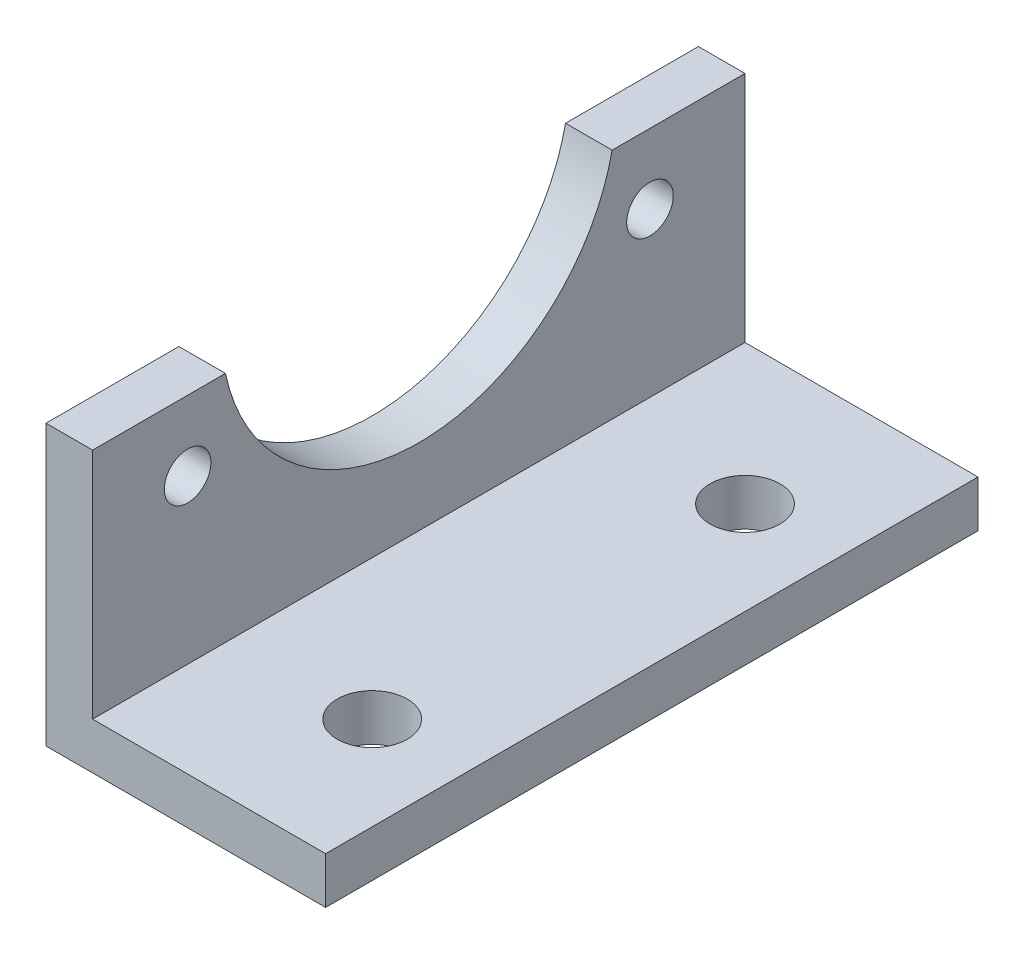
ISO-10303-21;
HEADER;
FILE_DESCRIPTION(('STEP AP214'),'2;1');
FILE_NAME('part.step','',(''),(''),'','','');
FILE_SCHEMA(('AUTOMOTIVE_DESIGN { 1 0 10303 214 1 1 1 1 }'));
ENDSEC;
DATA;
#1=APPLICATION_CONTEXT('core data for automotive mechanical design processes');
#2=APPLICATION_PROTOCOL_DEFINITION('international standard','automotive_design',2000,#1);
#3=PRODUCT_CONTEXT('',#1,'mechanical');
#4=PRODUCT('Part','Part','',(#3));
#5=PRODUCT_RELATED_PRODUCT_CATEGORY('part','',(#4));
#6=PRODUCT_DEFINITION_FORMATION('','',#4);
#7=PRODUCT_DEFINITION_CONTEXT('part definition',#1,'design');
#8=PRODUCT_DEFINITION('design','',#6,#7);
#9=PRODUCT_DEFINITION_SHAPE('','',#8);
#10=(LENGTH_UNIT() NAMED_UNIT(*) SI_UNIT(.MILLI.,.METRE.));
#11=(NAMED_UNIT(*) PLANE_ANGLE_UNIT() SI_UNIT($,.RADIAN.));
#12=(NAMED_UNIT(*) SI_UNIT($,.STERADIAN.) SOLID_ANGLE_UNIT());
#13=UNCERTAINTY_MEASURE_WITH_UNIT(LENGTH_MEASURE(1.E-05),#10,'distance_accuracy_value','');
#14=(GEOMETRIC_REPRESENTATION_CONTEXT(3) GLOBAL_UNCERTAINTY_ASSIGNED_CONTEXT((#13)) GLOBAL_UNIT_ASSIGNED_CONTEXT((#10,
#11,#12)) REPRESENTATION_CONTEXT('',''));
#15=CARTESIAN_POINT('',(0.,0.,0.));
#16=DIRECTION('',(0.,0.,1.));
#17=DIRECTION('',(1.,0.,0.));
#18=AXIS2_PLACEMENT_3D('',#15,#16,#17);
#19=CARTESIAN_POINT('',(6.35,38.1,88.9));
#20=DIRECTION('',(-1.,0.,0.));
#21=DIRECTION('',(0.,-1.,0.));
#22=AXIS2_PLACEMENT_3D('',#19,#20,#21);
#23=PLANE('',#22);
#24=CARTESIAN_POINT('',(6.34999999999999,28.5749999999998,12.9499999999998));
#25=DIRECTION('',(-1.,0.,0.));
#26=DIRECTION('',(0.,-1.,0.));
#27=AXIS2_PLACEMENT_3D('',#24,#25,#26);
#28=CIRCLE('',#27,3.17499999999999);
#29=CARTESIAN_POINT('',(6.34999999999999,25.3999999999998,12.9499999999998));
#30=VERTEX_POINT('',#29);
#31=EDGE_CURVE('E140',#30,#30,#28,.T.);
#32=ORIENTED_EDGE('',*,*,#31,.T.);
#33=EDGE_LOOP('',(#32));
#34=FACE_BOUND('',#33,.T.);
#35=CARTESIAN_POINT('',(6.34999999999999,28.5750000000002,75.9500000000001));
#36=DIRECTION('',(-1.,0.,0.));
#37=DIRECTION('',(0.,-1.,0.));
#38=AXIS2_PLACEMENT_3D('',#35,#36,#37);
#39=CIRCLE('',#38,3.1750000000002);
#40=CARTESIAN_POINT('',(6.34999999999999,25.3999999999999,75.9500000000001));
#41=VERTEX_POINT('',#40);
#42=EDGE_CURVE('E183',#41,#41,#39,.T.);
#43=ORIENTED_EDGE('',*,*,#42,.T.);
#44=EDGE_LOOP('',(#43));
#45=FACE_BOUND('',#44,.T.);
#46=CARTESIAN_POINT('',(6.34999999999999,43.6582895947802,44.4499999999997));
#47=DIRECTION('',(-1.,0.,0.));
#48=DIRECTION('',(0.,-1.,0.));
#49=AXIS2_PLACEMENT_3D('',#46,#47,#48);
#50=CIRCLE('',#49,26.9249999999999);
#51=CARTESIAN_POINT('',(6.35000000000002,38.1,70.7950382763159));
#52=VERTEX_POINT('',#51);
#53=CARTESIAN_POINT('',(6.35000000000002,38.1,18.1049617236839));
#54=VERTEX_POINT('',#53);
#55=EDGE_CURVE('E122',#52,#54,#50,.F.);
#56=ORIENTED_EDGE('',*,*,#55,.F.);
#57=DIRECTION('',(0.,0.,-1.));
#58=VECTOR('',#57,1.);
#59=CARTESIAN_POINT('',(6.35,38.1,88.9));
#60=LINE('',#59,#58);
#61=CARTESIAN_POINT('',(6.35,38.1,88.9));
#62=VERTEX_POINT('',#61);
#63=EDGE_CURVE('E119',#62,#52,#60,.T.);
#64=ORIENTED_EDGE('',*,*,#63,.F.);
#65=DIRECTION('',(0.,1.,0.));
#66=VECTOR('',#65,1.);
#67=CARTESIAN_POINT('',(6.35,38.1,88.9));
#68=LINE('',#67,#66);
#69=CARTESIAN_POINT('',(6.35,6.34999999999998,88.9));
#70=VERTEX_POINT('',#69);
#71=EDGE_CURVE('E105',#70,#62,#68,.T.);
#72=ORIENTED_EDGE('',*,*,#71,.F.);
#73=DIRECTION('',(0.,0.,-1.));
#74=VECTOR('',#73,1.);
#75=CARTESIAN_POINT('',(6.35,6.34999999999998,88.9));
#76=LINE('',#75,#74);
#77=CARTESIAN_POINT('',(6.35,6.34999999999998,0.));
#78=VERTEX_POINT('',#77);
#79=EDGE_CURVE('E125',#70,#78,#76,.T.);
#80=ORIENTED_EDGE('',*,*,#79,.T.);
#81=DIRECTION('',(0.,1.,0.));
#82=VECTOR('',#81,1.);
#83=CARTESIAN_POINT('',(6.35,38.1,0.));
#84=LINE('',#83,#82);
#85=CARTESIAN_POINT('',(6.35,38.1,0.));
#86=VERTEX_POINT('',#85);
#87=EDGE_CURVE('E144',#78,#86,#84,.T.);
#88=ORIENTED_EDGE('',*,*,#87,.T.);
#89=EDGE_CURVE('E126',#54,#86,#60,.T.);
#90=ORIENTED_EDGE('',*,*,#89,.F.);
#91=EDGE_LOOP('',(#56,#64,#72,#80,#88,#90));
#92=FACE_BOUND('',#91,.T.);
#93=ADVANCED_FACE('F36',(#34,#45,#92),#23,.F.);
#94=CARTESIAN_POINT('',(0.,38.1,88.9));
#95=DIRECTION('',(0.,-1.,0.));
#96=DIRECTION('',(0.,0.,-1.));
#97=AXIS2_PLACEMENT_3D('',#94,#95,#96);
#98=PLANE('',#97);
#99=DIRECTION('',(-1.,0.,0.));
#100=VECTOR('',#99,1.);
#101=CARTESIAN_POINT('',(76.2,38.1,70.7950382763159));
#102=LINE('',#101,#100);
#103=CARTESIAN_POINT('',(0.,38.1,70.7950382763159));
#104=VERTEX_POINT('',#103);
#105=EDGE_CURVE('E179',#52,#104,#102,.T.);
#106=ORIENTED_EDGE('',*,*,#105,.T.);
#107=DIRECTION('',(0.,0.,-1.));
#108=VECTOR('',#107,1.);
#109=CARTESIAN_POINT('',(0.,38.1,88.9));
#110=LINE('',#109,#108);
#111=CARTESIAN_POINT('',(0.,38.1,88.9));
#112=VERTEX_POINT('',#111);
#113=EDGE_CURVE('E130',#112,#104,#110,.T.);
#114=ORIENTED_EDGE('',*,*,#113,.F.);
#115=DIRECTION('',(-1.,0.,0.));
#116=VECTOR('',#115,1.);
#117=CARTESIAN_POINT('',(0.,38.1,88.9));
#118=LINE('',#117,#116);
#119=EDGE_CURVE('E109',#62,#112,#118,.T.);
#120=ORIENTED_EDGE('',*,*,#119,.F.);
#121=ORIENTED_EDGE('',*,*,#63,.T.);
#122=EDGE_LOOP('',(#106,#114,#120,#121));
#123=FACE_BOUND('',#122,.T.);
#124=ADVANCED_FACE('F128',(#123),#98,.F.);
#125=DIRECTION('',(-1.,0.,0.));
#126=VECTOR('',#125,1.);
#127=CARTESIAN_POINT('',(76.2,38.1,18.1049617236839));
#128=LINE('',#127,#126);
#129=CARTESIAN_POINT('',(0.,38.1,18.1049617236839));
#130=VERTEX_POINT('',#129);
#131=EDGE_CURVE('E53',#54,#130,#128,.T.);
#132=ORIENTED_EDGE('',*,*,#131,.F.);
#133=ORIENTED_EDGE('',*,*,#89,.T.);
#134=DIRECTION('',(-1.,0.,0.));
#135=VECTOR('',#134,1.);
#136=CARTESIAN_POINT('',(0.,38.1,0.));
#137=LINE('',#136,#135);
#138=CARTESIAN_POINT('',(0.,38.1,0.));
#139=VERTEX_POINT('',#138);
#140=EDGE_CURVE('E147',#86,#139,#137,.T.);
#141=ORIENTED_EDGE('',*,*,#140,.T.);
#142=EDGE_CURVE('E153',#130,#139,#110,.T.);
#143=ORIENTED_EDGE('',*,*,#142,.F.);
#144=EDGE_LOOP('',(#132,#133,#141,#143));
#145=FACE_BOUND('',#144,.T.);
#146=ADVANCED_FACE('F202',(#145),#98,.F.);
#147=CARTESIAN_POINT('',(0.,0.,88.9));
#148=DIRECTION('',(1.,0.,0.));
#149=DIRECTION('',(0.,0.,-1.));
#150=AXIS2_PLACEMENT_3D('',#147,#148,#149);
#151=PLANE('',#150);
#152=CARTESIAN_POINT('',(0.,28.5749999999998,12.9499999999998));
#153=DIRECTION('',(-1.,0.,0.));
#154=DIRECTION('',(0.,0.,1.));
#155=AXIS2_PLACEMENT_3D('',#152,#153,#154);
#156=CIRCLE('',#155,3.17499999999999);
#157=CARTESIAN_POINT('',(0.,28.5749999999998,16.1249999999998));
#158=VERTEX_POINT('',#157);
#159=EDGE_CURVE('E172',#158,#158,#156,.T.);
#160=ORIENTED_EDGE('',*,*,#159,.F.);
#161=EDGE_LOOP('',(#160));
#162=FACE_BOUND('',#161,.T.);
#163=CARTESIAN_POINT('',(0.,28.5750000000002,75.9500000000001));
#164=DIRECTION('',(-1.,0.,0.));
#165=DIRECTION('',(0.,0.,1.));
#166=AXIS2_PLACEMENT_3D('',#163,#164,#165);
#167=CIRCLE('',#166,3.1750000000002);
#168=CARTESIAN_POINT('',(0.,28.5750000000002,79.1250000000003));
#169=VERTEX_POINT('',#168);
#170=EDGE_CURVE('E175',#169,#169,#167,.T.);
#171=ORIENTED_EDGE('',*,*,#170,.F.);
#172=EDGE_LOOP('',(#171));
#173=FACE_BOUND('',#172,.T.);
#174=CARTESIAN_POINT('',(0.,43.6582895947802,44.4499999999997));
#175=DIRECTION('',(-1.,0.,0.));
#176=DIRECTION('',(0.,0.,1.));
#177=AXIS2_PLACEMENT_3D('',#174,#175,#176);
#178=CIRCLE('',#177,26.9249999999999);
#179=EDGE_CURVE('E163',#104,#130,#178,.F.);
#180=ORIENTED_EDGE('',*,*,#179,.T.);
#181=ORIENTED_EDGE('',*,*,#142,.T.);
#182=DIRECTION('',(0.,-1.,0.));
#183=VECTOR('',#182,1.);
#184=CARTESIAN_POINT('',(0.,0.,0.));
#185=LINE('',#184,#183);
#186=CARTESIAN_POINT('',(0.,0.,0.));
#187=VERTEX_POINT('',#186);
#188=EDGE_CURVE('E88',#139,#187,#185,.T.);
#189=ORIENTED_EDGE('',*,*,#188,.T.);
#190=DIRECTION('',(0.,0.,-1.));
#191=VECTOR('',#190,1.);
#192=CARTESIAN_POINT('',(0.,0.,88.9));
#193=LINE('',#192,#191);
#194=CARTESIAN_POINT('',(0.,0.,88.9));
#195=VERTEX_POINT('',#194);
#196=EDGE_CURVE('E132',#195,#187,#193,.T.);
#197=ORIENTED_EDGE('',*,*,#196,.F.);
#198=DIRECTION('',(0.,-1.,0.));
#199=VECTOR('',#198,1.);
#200=CARTESIAN_POINT('',(0.,0.,88.9));
#201=LINE('',#200,#199);
#202=EDGE_CURVE('E62',#112,#195,#201,.T.);
#203=ORIENTED_EDGE('',*,*,#202,.F.);
#204=ORIENTED_EDGE('',*,*,#113,.T.);
#205=EDGE_LOOP('',(#180,#181,#189,#197,#203,#204));
#206=FACE_BOUND('',#205,.T.);
#207=ADVANCED_FACE('F207',(#162,#173,#206),#151,.F.);
#208=CARTESIAN_POINT('',(0.,0.,88.9));
#209=DIRECTION('',(0.,1.,0.));
#210=DIRECTION('',(-1.,0.,0.));
#211=AXIS2_PLACEMENT_3D('',#208,#209,#210);
#212=PLANE('',#211);
#213=CARTESIAN_POINT('',(25.4,0.,69.85));
#214=DIRECTION('',(0.,-1.,0.));
#215=DIRECTION('',(1.,0.,0.));
#216=AXIS2_PLACEMENT_3D('',#213,#214,#215);
#217=CIRCLE('',#216,4.7625);
#218=CARTESIAN_POINT('',(30.1625,-1.04372529137938E-13,69.85));
#219=VERTEX_POINT('',#218);
#220=EDGE_CURVE('E159',#219,#219,#217,.T.);
#221=ORIENTED_EDGE('',*,*,#220,.F.);
#222=EDGE_LOOP('',(#221));
#223=FACE_BOUND('',#222,.T.);
#224=CARTESIAN_POINT('',(25.4,0.,19.05));
#225=DIRECTION('',(0.,-1.,0.));
#226=DIRECTION('',(-1.,0.,0.));
#227=AXIS2_PLACEMENT_3D('',#224,#225,#226);
#228=CIRCLE('',#227,4.7625);
#229=CARTESIAN_POINT('',(20.6375,0.,19.05));
#230=VERTEX_POINT('',#229);
#231=EDGE_CURVE('E165',#230,#230,#228,.T.);
#232=ORIENTED_EDGE('',*,*,#231,.F.);
#233=EDGE_LOOP('',(#232));
#234=FACE_BOUND('',#233,.T.);
#235=DIRECTION('',(1.,0.,0.));
#236=VECTOR('',#235,1.);
#237=CARTESIAN_POINT('',(0.,0.,0.));
#238=LINE('',#237,#236);
#239=CARTESIAN_POINT('',(38.1,-1.31838984174237E-13,0.));
#240=VERTEX_POINT('',#239);
#241=EDGE_CURVE('E136',#187,#240,#238,.T.);
#242=ORIENTED_EDGE('',*,*,#241,.T.);
#243=DIRECTION('',(0.,0.,-1.));
#244=VECTOR('',#243,1.);
#245=CARTESIAN_POINT('',(38.1,-1.31838984174237E-13,88.9));
#246=LINE('',#245,#244);
#247=CARTESIAN_POINT('',(38.1,-1.31838984174237E-13,88.9));
#248=VERTEX_POINT('',#247);
#249=EDGE_CURVE('E11',#248,#240,#246,.T.);
#250=ORIENTED_EDGE('',*,*,#249,.F.);
#251=DIRECTION('',(1.,0.,0.));
#252=VECTOR('',#251,1.);
#253=CARTESIAN_POINT('',(0.,0.,88.9));
#254=LINE('',#253,#252);
#255=EDGE_CURVE('E151',#195,#248,#254,.T.);
#256=ORIENTED_EDGE('',*,*,#255,.F.);
#257=ORIENTED_EDGE('',*,*,#196,.T.);
#258=EDGE_LOOP('',(#242,#250,#256,#257));
#259=FACE_BOUND('',#258,.T.);
#260=ADVANCED_FACE('F38',(#223,#234,#259),#212,.F.);
#261=CARTESIAN_POINT('',(38.1,-1.31838984174237E-13,88.9));
#262=DIRECTION('',(-1.,0.,0.));
#263=DIRECTION('',(0.,-1.,0.));
#264=AXIS2_PLACEMENT_3D('',#261,#262,#263);
#265=PLANE('',#264);
#266=DIRECTION('',(0.,1.,0.));
#267=VECTOR('',#266,1.);
#268=CARTESIAN_POINT('',(38.1,-1.31838984174237E-13,0.));
#269=LINE('',#268,#267);
#270=CARTESIAN_POINT('',(38.1,6.34999999999987,0.));
#271=VERTEX_POINT('',#270);
#272=EDGE_CURVE('E139',#240,#271,#269,.T.);
#273=ORIENTED_EDGE('',*,*,#272,.T.);
#274=DIRECTION('',(0.,0.,-1.));
#275=VECTOR('',#274,1.);
#276=CARTESIAN_POINT('',(38.1,6.34999999999987,88.9));
#277=LINE('',#276,#275);
#278=CARTESIAN_POINT('',(38.1,6.34999999999987,88.9));
#279=VERTEX_POINT('',#278);
#280=EDGE_CURVE('E45',#279,#271,#277,.T.);
#281=ORIENTED_EDGE('',*,*,#280,.F.);
#282=DIRECTION('',(0.,1.,0.));
#283=VECTOR('',#282,1.);
#284=CARTESIAN_POINT('',(38.1,-1.31838984174237E-13,88.9));
#285=LINE('',#284,#283);
#286=EDGE_CURVE('E96',#248,#279,#285,.T.);
#287=ORIENTED_EDGE('',*,*,#286,.F.);
#288=ORIENTED_EDGE('',*,*,#249,.T.);
#289=EDGE_LOOP('',(#273,#281,#287,#288));
#290=FACE_BOUND('',#289,.T.);
#291=ADVANCED_FACE('F191',(#290),#265,.F.);
#292=CARTESIAN_POINT('',(38.1,6.34999999999987,88.9));
#293=DIRECTION('',(0.,-1.,0.));
#294=DIRECTION('',(1.,0.,0.));
#295=AXIS2_PLACEMENT_3D('',#292,#293,#294);
#296=PLANE('',#295);
#297=CARTESIAN_POINT('',(25.4,6.34999999999991,69.85));
#298=DIRECTION('',(0.,-1.,0.));
#299=DIRECTION('',(1.,0.,0.));
#300=AXIS2_PLACEMENT_3D('',#297,#298,#299);
#301=CIRCLE('',#300,4.7625);
#302=CARTESIAN_POINT('',(30.1625,6.34999999999989,69.85));
#303=VERTEX_POINT('',#302);
#304=EDGE_CURVE('E40',#303,#303,#301,.T.);
#305=ORIENTED_EDGE('',*,*,#304,.T.);
#306=EDGE_LOOP('',(#305));
#307=FACE_BOUND('',#306,.T.);
#308=CARTESIAN_POINT('',(25.4,6.34999999999991,19.05));
#309=DIRECTION('',(0.,-1.,0.));
#310=DIRECTION('',(1.,0.,0.));
#311=AXIS2_PLACEMENT_3D('',#308,#309,#310);
#312=CIRCLE('',#311,4.7625);
#313=CARTESIAN_POINT('',(30.1625,6.34999999999989,19.05));
#314=VERTEX_POINT('',#313);
#315=EDGE_CURVE('E157',#314,#314,#312,.T.);
#316=ORIENTED_EDGE('',*,*,#315,.T.);
#317=EDGE_LOOP('',(#316));
#318=FACE_BOUND('',#317,.T.);
#319=DIRECTION('',(-1.,0.,0.));
#320=VECTOR('',#319,1.);
#321=CARTESIAN_POINT('',(38.1,6.34999999999987,0.));
#322=LINE('',#321,#320);
#323=EDGE_CURVE('E142',#271,#78,#322,.T.);
#324=ORIENTED_EDGE('',*,*,#323,.T.);
#325=ORIENTED_EDGE('',*,*,#79,.F.);
#326=DIRECTION('',(-1.,0.,0.));
#327=VECTOR('',#326,1.);
#328=CARTESIAN_POINT('',(38.1,6.34999999999987,88.9));
#329=LINE('',#328,#327);
#330=EDGE_CURVE('E112',#279,#70,#329,.T.);
#331=ORIENTED_EDGE('',*,*,#330,.F.);
#332=ORIENTED_EDGE('',*,*,#280,.T.);
#333=EDGE_LOOP('',(#324,#325,#331,#332));
#334=FACE_BOUND('',#333,.T.);
#335=ADVANCED_FACE('F194',(#307,#318,#334),#296,.F.);
#336=CARTESIAN_POINT('',(0.,0.,88.9));
#337=DIRECTION('',(0.,0.,1.));
#338=DIRECTION('',(1.,0.,0.));
#339=AXIS2_PLACEMENT_3D('',#336,#337,#338);
#340=PLANE('',#339);
#341=ORIENTED_EDGE('',*,*,#255,.T.);
#342=ORIENTED_EDGE('',*,*,#286,.T.);
#343=ORIENTED_EDGE('',*,*,#330,.T.);
#344=ORIENTED_EDGE('',*,*,#71,.T.);
#345=ORIENTED_EDGE('',*,*,#119,.T.);
#346=ORIENTED_EDGE('',*,*,#202,.T.);
#347=EDGE_LOOP('',(#341,#342,#343,#344,#345,#346));
#348=FACE_BOUND('',#347,.T.);
#349=ADVANCED_FACE('F107',(#348),#340,.T.);
#350=CARTESIAN_POINT('',(0.,0.,0.));
#351=DIRECTION('',(0.,0.,1.));
#352=DIRECTION('',(1.,0.,0.));
#353=AXIS2_PLACEMENT_3D('',#350,#351,#352);
#354=PLANE('',#353);
#355=ORIENTED_EDGE('',*,*,#241,.F.);
#356=ORIENTED_EDGE('',*,*,#188,.F.);
#357=ORIENTED_EDGE('',*,*,#140,.F.);
#358=ORIENTED_EDGE('',*,*,#87,.F.);
#359=ORIENTED_EDGE('',*,*,#323,.F.);
#360=ORIENTED_EDGE('',*,*,#272,.F.);
#361=EDGE_LOOP('',(#355,#356,#357,#358,#359,#360));
#362=FACE_BOUND('',#361,.T.);
#363=ADVANCED_FACE('F199',(#362),#354,.F.);
#364=CARTESIAN_POINT('',(76.2,43.6582895947802,44.4499999999997));
#365=DIRECTION('',(-1.,0.,0.));
#366=DIRECTION('',(0.,0.,1.));
#367=AXIS2_PLACEMENT_3D('',#364,#365,#366);
#368=CYLINDRICAL_SURFACE('',#367,26.9249999999999);
#369=ORIENTED_EDGE('',*,*,#55,.T.);
#370=ORIENTED_EDGE('',*,*,#131,.T.);
#371=ORIENTED_EDGE('',*,*,#179,.F.);
#372=ORIENTED_EDGE('',*,*,#105,.F.);
#373=EDGE_LOOP('',(#369,#370,#371,#372));
#374=FACE_BOUND('',#373,.T.);
#375=ADVANCED_FACE('F206',(#374),#368,.F.);
#376=CARTESIAN_POINT('',(76.2,28.5750000000002,75.9500000000001));
#377=DIRECTION('',(-1.,0.,0.));
#378=DIRECTION('',(0.,0.,1.));
#379=AXIS2_PLACEMENT_3D('',#376,#377,#378);
#380=CYLINDRICAL_SURFACE('',#379,3.1750000000002);
#381=ORIENTED_EDGE('',*,*,#170,.T.);
#382=EDGE_LOOP('',(#381));
#383=FACE_BOUND('',#382,.T.);
#384=ORIENTED_EDGE('',*,*,#42,.F.);
#385=EDGE_LOOP('',(#384));
#386=FACE_BOUND('',#385,.T.);
#387=ADVANCED_FACE('F248',(#383,#386),#380,.F.);
#388=CARTESIAN_POINT('',(76.2,28.5749999999998,12.9499999999998));
#389=DIRECTION('',(-1.,0.,0.));
#390=DIRECTION('',(0.,0.,1.));
#391=AXIS2_PLACEMENT_3D('',#388,#389,#390);
#392=CYLINDRICAL_SURFACE('',#391,3.17499999999999);
#393=ORIENTED_EDGE('',*,*,#159,.T.);
#394=EDGE_LOOP('',(#393));
#395=FACE_BOUND('',#394,.T.);
#396=ORIENTED_EDGE('',*,*,#31,.F.);
#397=EDGE_LOOP('',(#396));
#398=FACE_BOUND('',#397,.T.);
#399=ADVANCED_FACE('F242',(#395,#398),#392,.F.);
#400=CARTESIAN_POINT('',(25.4000000000001,38.1,19.05));
#401=DIRECTION('',(0.,-1.,0.));
#402=DIRECTION('',(1.,0.,0.));
#403=AXIS2_PLACEMENT_3D('',#400,#401,#402);
#404=CYLINDRICAL_SURFACE('',#403,4.7625);
#405=ORIENTED_EDGE('',*,*,#231,.T.);
#406=EDGE_LOOP('',(#405));
#407=FACE_BOUND('',#406,.T.);
#408=ORIENTED_EDGE('',*,*,#315,.F.);
#409=EDGE_LOOP('',(#408));
#410=FACE_BOUND('',#409,.T.);
#411=ADVANCED_FACE('F237',(#407,#410),#404,.F.);
#412=CARTESIAN_POINT('',(25.4000000000001,38.1,69.85));
#413=DIRECTION('',(0.,-1.,0.));
#414=DIRECTION('',(1.,0.,0.));
#415=AXIS2_PLACEMENT_3D('',#412,#413,#414);
#416=CYLINDRICAL_SURFACE('',#415,4.7625);
#417=ORIENTED_EDGE('',*,*,#220,.T.);
#418=EDGE_LOOP('',(#417));
#419=FACE_BOUND('',#418,.T.);
#420=ORIENTED_EDGE('',*,*,#304,.F.);
#421=EDGE_LOOP('',(#420));
#422=FACE_BOUND('',#421,.T.);
#423=ADVANCED_FACE('F235',(#419,#422),#416,.F.);
#424=CLOSED_SHELL('',(#93,#124,#146,#207,#260,#291,#335,#349,#363,#375,#387,#399,#411,#423));
#425=MANIFOLD_SOLID_BREP('B2',#424);
#426=ADVANCED_BREP_SHAPE_REPRESENTATION('',(#18,#425),#14);
#427=SHAPE_DEFINITION_REPRESENTATION(#9,#426);
ENDSEC;
END-ISO-10303-21;
